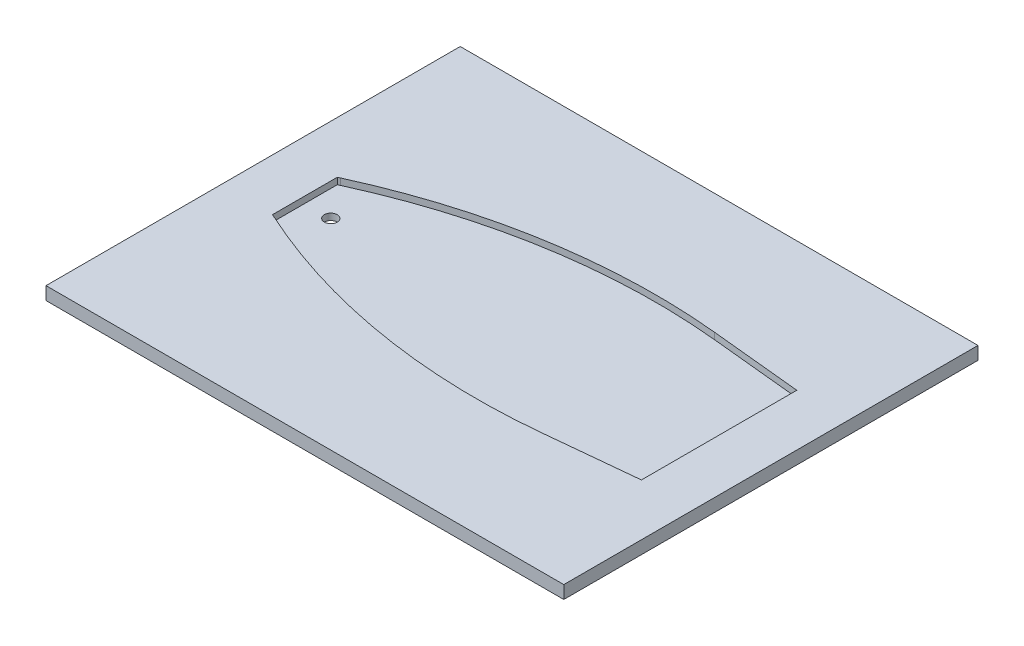
ISO-10303-21;
HEADER;
FILE_DESCRIPTION(('STEP AP214'),'2;1');
FILE_NAME('part.step','',(''),(''),'','','');
FILE_SCHEMA(('AUTOMOTIVE_DESIGN { 1 0 10303 214 1 1 1 1 }'));
ENDSEC;
DATA;
#1=APPLICATION_CONTEXT('core data for automotive mechanical design processes');
#2=APPLICATION_PROTOCOL_DEFINITION('international standard','automotive_design',2000,#1);
#3=PRODUCT_CONTEXT('',#1,'mechanical');
#4=PRODUCT('Part','Part','',(#3));
#5=PRODUCT_RELATED_PRODUCT_CATEGORY('part','',(#4));
#6=PRODUCT_DEFINITION_FORMATION('','',#4);
#7=PRODUCT_DEFINITION_CONTEXT('part definition',#1,'design');
#8=PRODUCT_DEFINITION('design','',#6,#7);
#9=PRODUCT_DEFINITION_SHAPE('','',#8);
#10=(LENGTH_UNIT() NAMED_UNIT(*) SI_UNIT(.MILLI.,.METRE.));
#11=(NAMED_UNIT(*) PLANE_ANGLE_UNIT() SI_UNIT($,.RADIAN.));
#12=(NAMED_UNIT(*) SI_UNIT($,.STERADIAN.) SOLID_ANGLE_UNIT());
#13=UNCERTAINTY_MEASURE_WITH_UNIT(LENGTH_MEASURE(1.E-05),#10,'distance_accuracy_value','');
#14=(GEOMETRIC_REPRESENTATION_CONTEXT(3) GLOBAL_UNCERTAINTY_ASSIGNED_CONTEXT((#13)) GLOBAL_UNIT_ASSIGNED_CONTEXT((#10,
#11,#12)) REPRESENTATION_CONTEXT('',''));
#15=CARTESIAN_POINT('',(0.,0.,0.));
#16=DIRECTION('',(0.,0.,1.));
#17=DIRECTION('',(1.,0.,0.));
#18=AXIS2_PLACEMENT_3D('',#15,#16,#17);
#19=CARTESIAN_POINT('',(-88.9,0.,0.));
#20=DIRECTION('',(0.,1.,0.));
#21=DIRECTION('',(0.,0.,1.));
#22=AXIS2_PLACEMENT_3D('',#19,#20,#21);
#23=CYLINDRICAL_SURFACE('',#22,3.175);
#24=CARTESIAN_POINT('',(-88.9,0.,0.));
#25=DIRECTION('',(0.,1.,0.));
#26=DIRECTION('',(0.,0.,1.));
#27=AXIS2_PLACEMENT_3D('',#24,#25,#26);
#28=CIRCLE('',#27,3.175);
#29=CARTESIAN_POINT('',(-88.9,0.,3.175));
#30=VERTEX_POINT('',#29);
#31=EDGE_CURVE('E174',#30,#30,#28,.T.);
#32=ORIENTED_EDGE('',*,*,#31,.F.);
#33=EDGE_LOOP('',(#32));
#34=FACE_BOUND('',#33,.T.);
#35=CARTESIAN_POINT('',(-88.9,3.175,0.));
#36=DIRECTION('',(0.,1.,0.));
#37=DIRECTION('',(0.,0.,1.));
#38=AXIS2_PLACEMENT_3D('',#35,#36,#37);
#39=CIRCLE('',#38,3.175);
#40=CARTESIAN_POINT('',(-88.9,3.175,3.175));
#41=VERTEX_POINT('',#40);
#42=EDGE_CURVE('E169',#41,#41,#39,.F.);
#43=ORIENTED_EDGE('',*,*,#42,.F.);
#44=EDGE_LOOP('',(#43));
#45=FACE_BOUND('',#44,.T.);
#46=ADVANCED_FACE('F32',(#34,#45),#23,.F.);
#47=CARTESIAN_POINT('',(127.,6.35,-101.6));
#48=DIRECTION('',(-1.,0.,0.));
#49=DIRECTION('',(0.,0.,1.));
#50=AXIS2_PLACEMENT_3D('',#47,#48,#49);
#51=PLANE('',#50);
#52=DIRECTION('',(0.,0.,-1.));
#53=VECTOR('',#52,1.);
#54=CARTESIAN_POINT('',(127.,0.,-101.6));
#55=LINE('',#54,#53);
#56=CARTESIAN_POINT('',(127.,0.,101.6));
#57=VERTEX_POINT('',#56);
#58=CARTESIAN_POINT('',(127.,0.,-101.6));
#59=VERTEX_POINT('',#58);
#60=EDGE_CURVE('E177',#57,#59,#55,.T.);
#61=ORIENTED_EDGE('',*,*,#60,.T.);
#62=DIRECTION('',(0.,-1.,0.));
#63=VECTOR('',#62,1.);
#64=CARTESIAN_POINT('',(127.,6.35,-101.6));
#65=LINE('',#64,#63);
#66=CARTESIAN_POINT('',(127.,6.35,-101.6));
#67=VERTEX_POINT('',#66);
#68=EDGE_CURVE('E204',#67,#59,#65,.T.);
#69=ORIENTED_EDGE('',*,*,#68,.F.);
#70=DIRECTION('',(0.,0.,-1.));
#71=VECTOR('',#70,1.);
#72=CARTESIAN_POINT('',(127.,6.35,-101.6));
#73=LINE('',#72,#71);
#74=CARTESIAN_POINT('',(127.,6.35,101.6));
#75=VERTEX_POINT('',#74);
#76=EDGE_CURVE('E178',#75,#67,#73,.T.);
#77=ORIENTED_EDGE('',*,*,#76,.F.);
#78=DIRECTION('',(0.,-1.,0.));
#79=VECTOR('',#78,1.);
#80=CARTESIAN_POINT('',(127.,6.35,101.6));
#81=LINE('',#80,#79);
#82=EDGE_CURVE('E188',#75,#57,#81,.T.);
#83=ORIENTED_EDGE('',*,*,#82,.T.);
#84=EDGE_LOOP('',(#61,#69,#77,#83));
#85=FACE_BOUND('',#84,.T.);
#86=ADVANCED_FACE('F247',(#85),#51,.F.);
#87=CARTESIAN_POINT('',(-127.,6.35,-101.6));
#88=DIRECTION('',(0.,0.,1.));
#89=DIRECTION('',(1.,0.,0.));
#90=AXIS2_PLACEMENT_3D('',#87,#88,#89);
#91=PLANE('',#90);
#92=DIRECTION('',(-1.,0.,0.));
#93=VECTOR('',#92,1.);
#94=CARTESIAN_POINT('',(-127.,0.,-101.6));
#95=LINE('',#94,#93);
#96=CARTESIAN_POINT('',(-127.,0.,-101.6));
#97=VERTEX_POINT('',#96);
#98=EDGE_CURVE('E191',#59,#97,#95,.T.);
#99=ORIENTED_EDGE('',*,*,#98,.T.);
#100=DIRECTION('',(0.,-1.,0.));
#101=VECTOR('',#100,1.);
#102=CARTESIAN_POINT('',(-127.,6.35,-101.6));
#103=LINE('',#102,#101);
#104=CARTESIAN_POINT('',(-127.,6.35,-101.6));
#105=VERTEX_POINT('',#104);
#106=EDGE_CURVE('E201',#105,#97,#103,.T.);
#107=ORIENTED_EDGE('',*,*,#106,.F.);
#108=DIRECTION('',(-1.,0.,0.));
#109=VECTOR('',#108,1.);
#110=CARTESIAN_POINT('',(-127.,6.35,-101.6));
#111=LINE('',#110,#109);
#112=EDGE_CURVE('E181',#67,#105,#111,.T.);
#113=ORIENTED_EDGE('',*,*,#112,.F.);
#114=ORIENTED_EDGE('',*,*,#68,.T.);
#115=EDGE_LOOP('',(#99,#107,#113,#114));
#116=FACE_BOUND('',#115,.T.);
#117=ADVANCED_FACE('F253',(#116),#91,.F.);
#118=CARTESIAN_POINT('',(-127.,6.35,-101.6));
#119=DIRECTION('',(1.,0.,0.));
#120=DIRECTION('',(0.,0.,-1.));
#121=AXIS2_PLACEMENT_3D('',#118,#119,#120);
#122=PLANE('',#121);
#123=DIRECTION('',(0.,0.,1.));
#124=VECTOR('',#123,1.);
#125=CARTESIAN_POINT('',(-127.,0.,-101.6));
#126=LINE('',#125,#124);
#127=CARTESIAN_POINT('',(-127.,0.,101.6));
#128=VERTEX_POINT('',#127);
#129=EDGE_CURVE('E193',#97,#128,#126,.T.);
#130=ORIENTED_EDGE('',*,*,#129,.T.);
#131=DIRECTION('',(0.,-1.,0.));
#132=VECTOR('',#131,1.);
#133=CARTESIAN_POINT('',(-127.,6.35,101.6));
#134=LINE('',#133,#132);
#135=CARTESIAN_POINT('',(-127.,6.35,101.6));
#136=VERTEX_POINT('',#135);
#137=EDGE_CURVE('E198',#136,#128,#134,.T.);
#138=ORIENTED_EDGE('',*,*,#137,.F.);
#139=DIRECTION('',(0.,0.,1.));
#140=VECTOR('',#139,1.);
#141=CARTESIAN_POINT('',(-127.,6.35,-101.6));
#142=LINE('',#141,#140);
#143=EDGE_CURVE('E184',#105,#136,#142,.T.);
#144=ORIENTED_EDGE('',*,*,#143,.F.);
#145=ORIENTED_EDGE('',*,*,#106,.T.);
#146=EDGE_LOOP('',(#130,#138,#144,#145));
#147=FACE_BOUND('',#146,.T.);
#148=ADVANCED_FACE('F270',(#147),#122,.F.);
#149=CARTESIAN_POINT('',(-127.,6.35,101.6));
#150=DIRECTION('',(0.,0.,-1.));
#151=DIRECTION('',(-1.,0.,0.));
#152=AXIS2_PLACEMENT_3D('',#149,#150,#151);
#153=PLANE('',#152);
#154=DIRECTION('',(1.,0.,0.));
#155=VECTOR('',#154,1.);
#156=CARTESIAN_POINT('',(-127.,0.,101.6));
#157=LINE('',#156,#155);
#158=EDGE_CURVE('E182',#128,#57,#157,.T.);
#159=ORIENTED_EDGE('',*,*,#158,.T.);
#160=ORIENTED_EDGE('',*,*,#82,.F.);
#161=DIRECTION('',(1.,0.,0.));
#162=VECTOR('',#161,1.);
#163=CARTESIAN_POINT('',(-127.,6.35,101.6));
#164=LINE('',#163,#162);
#165=EDGE_CURVE('E186',#136,#75,#164,.T.);
#166=ORIENTED_EDGE('',*,*,#165,.F.);
#167=ORIENTED_EDGE('',*,*,#137,.T.);
#168=EDGE_LOOP('',(#159,#160,#166,#167));
#169=FACE_BOUND('',#168,.T.);
#170=ADVANCED_FACE('F264',(#169),#153,.F.);
#171=CARTESIAN_POINT('',(0.,6.35,0.));
#172=DIRECTION('',(0.,1.,0.));
#173=DIRECTION('',(0.,0.,1.));
#174=AXIS2_PLACEMENT_3D('',#171,#172,#173);
#175=PLANE('',#174);
#176=DIRECTION('',(-0.909064822894284,0.,0.416654710493213));
#177=VECTOR('',#176,1.);
#178=CARTESIAN_POINT('',(-25.4,6.35,-50.8));
#179=LINE('',#178,#177);
#180=CARTESIAN_POINT('',(-100.510841473588,6.35,-16.3741976579387));
#181=VERTEX_POINT('',#180);
#182=CARTESIAN_POINT('',(-101.6,6.35,-15.875));
#183=VERTEX_POINT('',#182);
#184=EDGE_CURVE('E136',#181,#183,#179,.T.);
#185=ORIENTED_EDGE('',*,*,#184,.F.);
#186=CARTESIAN_POINT('',(26.4855142847433,6.35,260.708760360239));
#187=DIRECTION('',(0.,1.,0.));
#188=DIRECTION('',(0.,0.,1.));
#189=AXIS2_PLACEMENT_3D('',#186,#187,#188);
#190=CIRCLE('',#189,304.8);
#191=CARTESIAN_POINT('',(56.8142478423437,6.35,-42.5785752157656));
#192=VERTEX_POINT('',#191);
#193=EDGE_CURVE('E11',#181,#192,#190,.F.);
#194=ORIENTED_EDGE('',*,*,#193,.T.);
#195=DIRECTION('',(-0.995037190209989,0.,-0.0995037190209987));
#196=VECTOR('',#195,1.);
#197=CARTESIAN_POINT('',(101.6,6.35,-38.1));
#198=LINE('',#197,#196);
#199=CARTESIAN_POINT('',(101.6,6.35,-38.1));
#200=VERTEX_POINT('',#199);
#201=EDGE_CURVE('E131',#200,#192,#198,.T.);
#202=ORIENTED_EDGE('',*,*,#201,.F.);
#203=DIRECTION('',(0.,0.,-1.));
#204=VECTOR('',#203,1.);
#205=CARTESIAN_POINT('',(101.6,6.35,38.1));
#206=LINE('',#205,#204);
#207=CARTESIAN_POINT('',(101.6,6.35,38.1));
#208=VERTEX_POINT('',#207);
#209=EDGE_CURVE('E163',#208,#200,#206,.T.);
#210=ORIENTED_EDGE('',*,*,#209,.F.);
#211=DIRECTION('',(0.995037190209989,0.,-0.099503719020999));
#212=VECTOR('',#211,1.);
#213=CARTESIAN_POINT('',(-25.4,6.35,50.8));
#214=LINE('',#213,#212);
#215=CARTESIAN_POINT('',(56.8142478423438,6.35,42.5785752157656));
#216=VERTEX_POINT('',#215);
#217=EDGE_CURVE('E161',#216,#208,#214,.T.);
#218=ORIENTED_EDGE('',*,*,#217,.F.);
#219=CARTESIAN_POINT('',(26.4855142847434,6.35,-260.708760360239));
#220=DIRECTION('',(0.,1.,0.));
#221=DIRECTION('',(0.,0.,1.));
#222=AXIS2_PLACEMENT_3D('',#219,#220,#221);
#223=CIRCLE('',#222,304.8);
#224=CARTESIAN_POINT('',(-100.510841473588,6.35,16.3741976579387));
#225=VERTEX_POINT('',#224);
#226=EDGE_CURVE('E40',#216,#225,#223,.F.);
#227=ORIENTED_EDGE('',*,*,#226,.T.);
#228=DIRECTION('',(0.909064822894284,0.,0.416654710493214));
#229=VECTOR('',#228,1.);
#230=CARTESIAN_POINT('',(-101.6,6.35,15.875));
#231=LINE('',#230,#229);
#232=CARTESIAN_POINT('',(-101.6,6.35,15.875));
#233=VERTEX_POINT('',#232);
#234=EDGE_CURVE('E158',#233,#225,#231,.T.);
#235=ORIENTED_EDGE('',*,*,#234,.F.);
#236=DIRECTION('',(0.,0.,1.));
#237=VECTOR('',#236,1.);
#238=CARTESIAN_POINT('',(-101.6,6.35,-15.875));
#239=LINE('',#238,#237);
#240=EDGE_CURVE('E156',#183,#233,#239,.T.);
#241=ORIENTED_EDGE('',*,*,#240,.F.);
#242=EDGE_LOOP('',(#185,#194,#202,#210,#218,#227,#235,#241));
#243=FACE_BOUND('',#242,.T.);
#244=ORIENTED_EDGE('',*,*,#76,.T.);
#245=ORIENTED_EDGE('',*,*,#112,.T.);
#246=ORIENTED_EDGE('',*,*,#143,.T.);
#247=ORIENTED_EDGE('',*,*,#165,.T.);
#248=EDGE_LOOP('',(#244,#245,#246,#247));
#249=FACE_BOUND('',#248,.T.);
#250=ADVANCED_FACE('F222',(#243,#249),#175,.T.);
#251=CARTESIAN_POINT('',(0.,0.,0.));
#252=DIRECTION('',(0.,1.,0.));
#253=DIRECTION('',(0.,0.,1.));
#254=AXIS2_PLACEMENT_3D('',#251,#252,#253);
#255=PLANE('',#254);
#256=ORIENTED_EDGE('',*,*,#31,.T.);
#257=EDGE_LOOP('',(#256));
#258=FACE_BOUND('',#257,.T.);
#259=ORIENTED_EDGE('',*,*,#60,.F.);
#260=ORIENTED_EDGE('',*,*,#158,.F.);
#261=ORIENTED_EDGE('',*,*,#129,.F.);
#262=ORIENTED_EDGE('',*,*,#98,.F.);
#263=EDGE_LOOP('',(#259,#260,#261,#262));
#264=FACE_BOUND('',#263,.T.);
#265=ADVANCED_FACE('F263',(#258,#264),#255,.F.);
#266=CARTESIAN_POINT('',(0.,3.175,0.));
#267=DIRECTION('',(0.,1.,0.));
#268=DIRECTION('',(0.,0.,1.));
#269=AXIS2_PLACEMENT_3D('',#266,#267,#268);
#270=PLANE('',#269);
#271=DIRECTION('',(0.909064822894284,0.,0.416654710493214));
#272=VECTOR('',#271,1.);
#273=CARTESIAN_POINT('',(-101.6,3.175,15.875));
#274=LINE('',#273,#272);
#275=CARTESIAN_POINT('',(-101.6,3.175,15.875));
#276=VERTEX_POINT('',#275);
#277=CARTESIAN_POINT('',(-100.510841473588,3.175,16.3741976579387));
#278=VERTEX_POINT('',#277);
#279=EDGE_CURVE('E145',#276,#278,#274,.T.);
#280=ORIENTED_EDGE('',*,*,#279,.T.);
#281=CARTESIAN_POINT('',(26.4855142847434,3.175,-260.708760360239));
#282=DIRECTION('',(0.,1.,0.));
#283=DIRECTION('',(0.,0.,1.));
#284=AXIS2_PLACEMENT_3D('',#281,#282,#283);
#285=CIRCLE('',#284,304.8);
#286=CARTESIAN_POINT('',(56.8142478423438,3.175,42.5785752157656));
#287=VERTEX_POINT('',#286);
#288=EDGE_CURVE('E215',#278,#287,#285,.T.);
#289=ORIENTED_EDGE('',*,*,#288,.T.);
#290=DIRECTION('',(0.995037190209989,0.,-0.099503719020999));
#291=VECTOR('',#290,1.);
#292=CARTESIAN_POINT('',(-25.4,3.175,50.8));
#293=LINE('',#292,#291);
#294=CARTESIAN_POINT('',(101.6,3.175,38.1));
#295=VERTEX_POINT('',#294);
#296=EDGE_CURVE('E147',#287,#295,#293,.T.);
#297=ORIENTED_EDGE('',*,*,#296,.T.);
#298=DIRECTION('',(0.,0.,-1.));
#299=VECTOR('',#298,1.);
#300=CARTESIAN_POINT('',(101.6,3.175,38.1));
#301=LINE('',#300,#299);
#302=CARTESIAN_POINT('',(101.6,3.175,-38.1));
#303=VERTEX_POINT('',#302);
#304=EDGE_CURVE('E151',#295,#303,#301,.T.);
#305=ORIENTED_EDGE('',*,*,#304,.T.);
#306=DIRECTION('',(-0.995037190209989,0.,-0.0995037190209987));
#307=VECTOR('',#306,1.);
#308=CARTESIAN_POINT('',(101.6,3.175,-38.1));
#309=LINE('',#308,#307);
#310=CARTESIAN_POINT('',(56.8142478423437,3.175,-42.5785752157656));
#311=VERTEX_POINT('',#310);
#312=EDGE_CURVE('E141',#303,#311,#309,.T.);
#313=ORIENTED_EDGE('',*,*,#312,.T.);
#314=CARTESIAN_POINT('',(26.4855142847433,3.175,260.708760360239));
#315=DIRECTION('',(0.,1.,0.));
#316=DIRECTION('',(0.,0.,1.));
#317=AXIS2_PLACEMENT_3D('',#314,#315,#316);
#318=CIRCLE('',#317,304.8);
#319=CARTESIAN_POINT('',(-100.510841473588,3.175,-16.3741976579387));
#320=VERTEX_POINT('',#319);
#321=EDGE_CURVE('E129',#311,#320,#318,.T.);
#322=ORIENTED_EDGE('',*,*,#321,.T.);
#323=DIRECTION('',(-0.909064822894284,0.,0.416654710493213));
#324=VECTOR('',#323,1.);
#325=CARTESIAN_POINT('',(-25.4,3.175,-50.8));
#326=LINE('',#325,#324);
#327=CARTESIAN_POINT('',(-101.6,3.175,-15.875));
#328=VERTEX_POINT('',#327);
#329=EDGE_CURVE('E120',#320,#328,#326,.T.);
#330=ORIENTED_EDGE('',*,*,#329,.T.);
#331=DIRECTION('',(0.,0.,1.));
#332=VECTOR('',#331,1.);
#333=CARTESIAN_POINT('',(-101.6,3.175,-15.875));
#334=LINE('',#333,#332);
#335=EDGE_CURVE('E126',#328,#276,#334,.T.);
#336=ORIENTED_EDGE('',*,*,#335,.T.);
#337=EDGE_LOOP('',(#280,#289,#297,#305,#313,#322,#330,#336));
#338=FACE_BOUND('',#337,.T.);
#339=ORIENTED_EDGE('',*,*,#42,.T.);
#340=EDGE_LOOP('',(#339));
#341=FACE_BOUND('',#340,.T.);
#342=ADVANCED_FACE('F123',(#338,#341),#270,.T.);
#343=CARTESIAN_POINT('',(-25.4,3.175,-50.8));
#344=DIRECTION('',(-0.416654710493213,0.,-0.909064822894284));
#345=DIRECTION('',(-0.909064822894284,0.,0.416654710493213));
#346=AXIS2_PLACEMENT_3D('',#343,#344,#345);
#347=PLANE('',#346);
#348=ORIENTED_EDGE('',*,*,#329,.F.);
#349=DIRECTION('',(0.,1.,0.));
#350=VECTOR('',#349,1.);
#351=CARTESIAN_POINT('',(-100.510841473588,6.35,-16.3741976579387));
#352=LINE('',#351,#350);
#353=EDGE_CURVE('E217',#320,#181,#352,.T.);
#354=ORIENTED_EDGE('',*,*,#353,.T.);
#355=ORIENTED_EDGE('',*,*,#184,.T.);
#356=DIRECTION('',(0.,1.,0.));
#357=VECTOR('',#356,1.);
#358=CARTESIAN_POINT('',(-101.6,3.175,-15.875));
#359=LINE('',#358,#357);
#360=EDGE_CURVE('E134',#328,#183,#359,.T.);
#361=ORIENTED_EDGE('',*,*,#360,.F.);
#362=EDGE_LOOP('',(#348,#354,#355,#361));
#363=FACE_BOUND('',#362,.T.);
#364=ADVANCED_FACE('F135',(#363),#347,.F.);
#365=CARTESIAN_POINT('',(101.6,3.175,-38.1));
#366=DIRECTION('',(0.0995037190209987,0.,-0.995037190209989));
#367=DIRECTION('',(-0.995037190209989,0.,-0.0995037190209987));
#368=AXIS2_PLACEMENT_3D('',#365,#366,#367);
#369=PLANE('',#368);
#370=ORIENTED_EDGE('',*,*,#201,.T.);
#371=DIRECTION('',(0.,1.,0.));
#372=VECTOR('',#371,1.);
#373=CARTESIAN_POINT('',(56.8142478423437,3.175,-42.5785752157656));
#374=LINE('',#373,#372);
#375=EDGE_CURVE('E219',#192,#311,#374,.F.);
#376=ORIENTED_EDGE('',*,*,#375,.T.);
#377=ORIENTED_EDGE('',*,*,#312,.F.);
#378=DIRECTION('',(0.,1.,0.));
#379=VECTOR('',#378,1.);
#380=CARTESIAN_POINT('',(101.6,3.175,-38.1));
#381=LINE('',#380,#379);
#382=EDGE_CURVE('E167',#303,#200,#381,.T.);
#383=ORIENTED_EDGE('',*,*,#382,.T.);
#384=EDGE_LOOP('',(#370,#376,#377,#383));
#385=FACE_BOUND('',#384,.T.);
#386=ADVANCED_FACE('F241',(#385),#369,.F.);
#387=CARTESIAN_POINT('',(101.6,3.175,38.1));
#388=DIRECTION('',(1.,0.,0.));
#389=DIRECTION('',(0.,0.,-1.));
#390=AXIS2_PLACEMENT_3D('',#387,#388,#389);
#391=PLANE('',#390);
#392=ORIENTED_EDGE('',*,*,#209,.T.);
#393=ORIENTED_EDGE('',*,*,#382,.F.);
#394=ORIENTED_EDGE('',*,*,#304,.F.);
#395=DIRECTION('',(0.,1.,0.));
#396=VECTOR('',#395,1.);
#397=CARTESIAN_POINT('',(101.6,3.175,38.1));
#398=LINE('',#397,#396);
#399=EDGE_CURVE('E170',#295,#208,#398,.T.);
#400=ORIENTED_EDGE('',*,*,#399,.T.);
#401=EDGE_LOOP('',(#392,#393,#394,#400));
#402=FACE_BOUND('',#401,.T.);
#403=ADVANCED_FACE('F238',(#402),#391,.F.);
#404=CARTESIAN_POINT('',(-25.4,3.175,50.8));
#405=DIRECTION('',(0.0995037190209991,0.,0.995037190209989));
#406=DIRECTION('',(0.995037190209989,0.,-0.0995037190209991));
#407=AXIS2_PLACEMENT_3D('',#404,#405,#406);
#408=PLANE('',#407);
#409=ORIENTED_EDGE('',*,*,#296,.F.);
#410=DIRECTION('',(0.,1.,0.));
#411=VECTOR('',#410,1.);
#412=CARTESIAN_POINT('',(56.8142478423439,6.35,42.5785752157656));
#413=LINE('',#412,#411);
#414=EDGE_CURVE('E207',#287,#216,#413,.T.);
#415=ORIENTED_EDGE('',*,*,#414,.T.);
#416=ORIENTED_EDGE('',*,*,#217,.T.);
#417=ORIENTED_EDGE('',*,*,#399,.F.);
#418=EDGE_LOOP('',(#409,#415,#416,#417));
#419=FACE_BOUND('',#418,.T.);
#420=ADVANCED_FACE('F235',(#419),#408,.F.);
#421=CARTESIAN_POINT('',(-101.6,3.175,15.875));
#422=DIRECTION('',(-0.416654710493214,0.,0.909064822894284));
#423=DIRECTION('',(0.909064822894284,0.,0.416654710493214));
#424=AXIS2_PLACEMENT_3D('',#421,#422,#423);
#425=PLANE('',#424);
#426=ORIENTED_EDGE('',*,*,#234,.T.);
#427=DIRECTION('',(0.,1.,0.));
#428=VECTOR('',#427,1.);
#429=CARTESIAN_POINT('',(-100.510841473588,3.175,16.3741976579387));
#430=LINE('',#429,#428);
#431=EDGE_CURVE('E212',#225,#278,#430,.F.);
#432=ORIENTED_EDGE('',*,*,#431,.T.);
#433=ORIENTED_EDGE('',*,*,#279,.F.);
#434=DIRECTION('',(0.,1.,0.));
#435=VECTOR('',#434,1.);
#436=CARTESIAN_POINT('',(-101.6,3.175,15.875));
#437=LINE('',#436,#435);
#438=EDGE_CURVE('E140',#276,#233,#437,.T.);
#439=ORIENTED_EDGE('',*,*,#438,.T.);
#440=EDGE_LOOP('',(#426,#432,#433,#439));
#441=FACE_BOUND('',#440,.T.);
#442=ADVANCED_FACE('F229',(#441),#425,.F.);
#443=CARTESIAN_POINT('',(-101.6,3.175,-15.875));
#444=DIRECTION('',(-1.,0.,0.));
#445=DIRECTION('',(0.,0.,1.));
#446=AXIS2_PLACEMENT_3D('',#443,#444,#445);
#447=PLANE('',#446);
#448=ORIENTED_EDGE('',*,*,#240,.T.);
#449=ORIENTED_EDGE('',*,*,#438,.F.);
#450=ORIENTED_EDGE('',*,*,#335,.F.);
#451=ORIENTED_EDGE('',*,*,#360,.T.);
#452=EDGE_LOOP('',(#448,#449,#450,#451));
#453=FACE_BOUND('',#452,.T.);
#454=ADVANCED_FACE('F143',(#453),#447,.F.);
#455=CARTESIAN_POINT('',(26.4855142847434,3.175,-260.708760360239));
#456=DIRECTION('',(0.,-1.,0.));
#457=DIRECTION('',(0.,0.,-1.));
#458=AXIS2_PLACEMENT_3D('',#455,#456,#457);
#459=CYLINDRICAL_SURFACE('',#458,304.8);
#460=ORIENTED_EDGE('',*,*,#288,.F.);
#461=ORIENTED_EDGE('',*,*,#431,.F.);
#462=ORIENTED_EDGE('',*,*,#226,.F.);
#463=ORIENTED_EDGE('',*,*,#414,.F.);
#464=EDGE_LOOP('',(#460,#461,#462,#463));
#465=FACE_BOUND('',#464,.T.);
#466=ADVANCED_FACE('F231',(#465),#459,.F.);
#467=CARTESIAN_POINT('',(26.4855142847433,3.175,260.708760360239));
#468=DIRECTION('',(0.,-1.,0.));
#469=DIRECTION('',(0.,0.,-1.));
#470=AXIS2_PLACEMENT_3D('',#467,#468,#469);
#471=CYLINDRICAL_SURFACE('',#470,304.8);
#472=ORIENTED_EDGE('',*,*,#321,.F.);
#473=ORIENTED_EDGE('',*,*,#375,.F.);
#474=ORIENTED_EDGE('',*,*,#193,.F.);
#475=ORIENTED_EDGE('',*,*,#353,.F.);
#476=EDGE_LOOP('',(#472,#473,#474,#475));
#477=FACE_BOUND('',#476,.T.);
#478=ADVANCED_FACE('F34',(#477),#471,.F.);
#479=CLOSED_SHELL('',(#46,#86,#117,#148,#170,#250,#265,#342,#364,#386,#403,#420,#442,#454,#466,#478));
#480=MANIFOLD_SOLID_BREP('B2',#479);
#481=ADVANCED_BREP_SHAPE_REPRESENTATION('',(#18,#480),#14);
#482=SHAPE_DEFINITION_REPRESENTATION(#9,#481);
ENDSEC;
END-ISO-10303-21;
